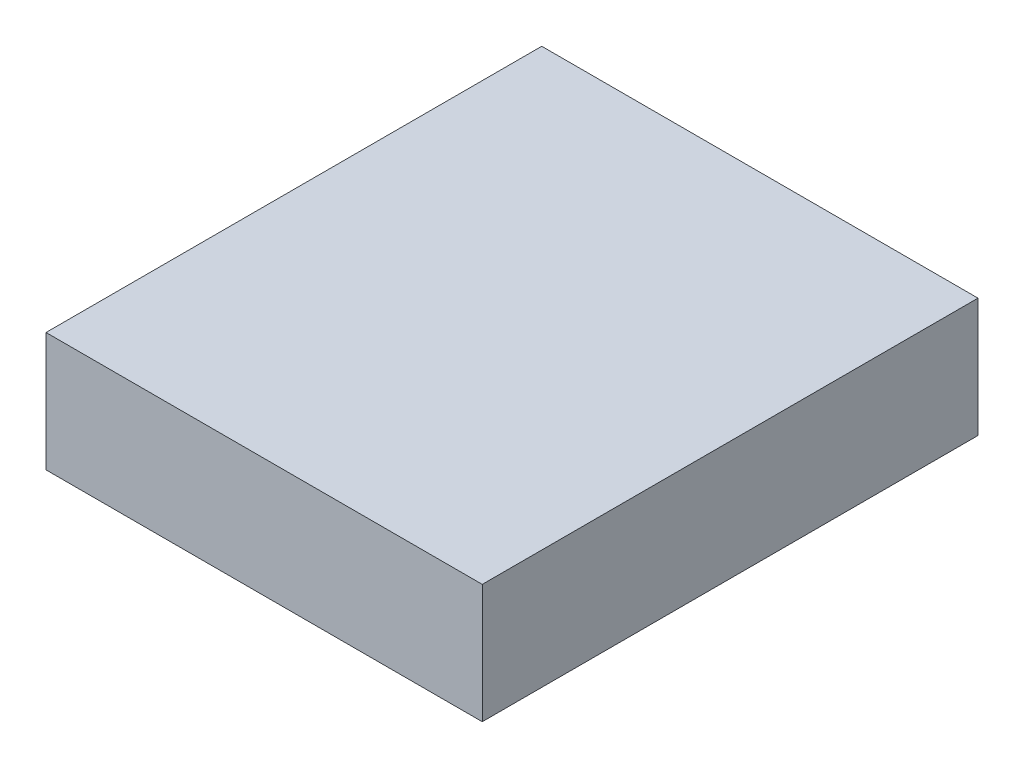
ISO-10303-21;
HEADER;
FILE_DESCRIPTION(('STEP AP214'),'2;1');
FILE_NAME('part.step','',(''),(''),'','','');
FILE_SCHEMA(('AUTOMOTIVE_DESIGN { 1 0 10303 214 1 1 1 1 }'));
ENDSEC;
DATA;
#1=APPLICATION_CONTEXT('core data for automotive mechanical design processes');
#2=APPLICATION_PROTOCOL_DEFINITION('international standard','automotive_design',2000,#1);
#3=PRODUCT_CONTEXT('',#1,'mechanical');
#4=PRODUCT('Part','Part','',(#3));
#5=PRODUCT_RELATED_PRODUCT_CATEGORY('part','',(#4));
#6=PRODUCT_DEFINITION_FORMATION('','',#4);
#7=PRODUCT_DEFINITION_CONTEXT('part definition',#1,'design');
#8=PRODUCT_DEFINITION('design','',#6,#7);
#9=PRODUCT_DEFINITION_SHAPE('','',#8);
#10=(LENGTH_UNIT() NAMED_UNIT(*) SI_UNIT(.MILLI.,.METRE.));
#11=(NAMED_UNIT(*) PLANE_ANGLE_UNIT() SI_UNIT($,.RADIAN.));
#12=(NAMED_UNIT(*) SI_UNIT($,.STERADIAN.) SOLID_ANGLE_UNIT());
#13=UNCERTAINTY_MEASURE_WITH_UNIT(LENGTH_MEASURE(1.E-05),#10,'distance_accuracy_value','');
#14=(GEOMETRIC_REPRESENTATION_CONTEXT(3) GLOBAL_UNCERTAINTY_ASSIGNED_CONTEXT((#13)) GLOBAL_UNIT_ASSIGNED_CONTEXT((#10,
#11,#12)) REPRESENTATION_CONTEXT('',''));
#15=CARTESIAN_POINT('',(0.,0.,0.));
#16=DIRECTION('',(0.,0.,1.));
#17=DIRECTION('',(1.,0.,0.));
#18=AXIS2_PLACEMENT_3D('',#15,#16,#17);
#19=CARTESIAN_POINT('',(0.7,6.6,-36.9));
#20=DIRECTION('',(0.,-1.,0.));
#21=DIRECTION('',(0.,0.,-1.));
#22=AXIS2_PLACEMENT_3D('',#19,#20,#21);
#23=PLANE('',#22);
#24=DIRECTION('',(-1.,0.,0.));
#25=VECTOR('',#24,1.);
#26=CARTESIAN_POINT('',(2.9,6.6,-41.9));
#27=LINE('',#26,#25);
#28=CARTESIAN_POINT('',(5.1,6.6,-41.9));
#29=VERTEX_POINT('',#28);
#30=CARTESIAN_POINT('',(0.7,6.6,-41.9));
#31=VERTEX_POINT('',#30);
#32=EDGE_CURVE('E54',#29,#31,#27,.T.);
#33=ORIENTED_EDGE('',*,*,#32,.F.);
#34=DIRECTION('',(0.,0.,-1.));
#35=VECTOR('',#34,1.);
#36=CARTESIAN_POINT('',(5.1,6.6,-39.4));
#37=LINE('',#36,#35);
#38=CARTESIAN_POINT('',(5.1,6.6,-36.9));
#39=VERTEX_POINT('',#38);
#40=EDGE_CURVE('E69',#39,#29,#37,.T.);
#41=ORIENTED_EDGE('',*,*,#40,.F.);
#42=DIRECTION('',(1.,0.,0.));
#43=VECTOR('',#42,1.);
#44=CARTESIAN_POINT('',(2.9,6.6,-36.9));
#45=LINE('',#44,#43);
#46=CARTESIAN_POINT('',(0.7,6.6,-36.9));
#47=VERTEX_POINT('',#46);
#48=EDGE_CURVE('E21',#47,#39,#45,.T.);
#49=ORIENTED_EDGE('',*,*,#48,.F.);
#50=DIRECTION('',(0.,0.,1.));
#51=VECTOR('',#50,1.);
#52=CARTESIAN_POINT('',(0.7,6.6,-39.4));
#53=LINE('',#52,#51);
#54=EDGE_CURVE('E59',#31,#47,#53,.T.);
#55=ORIENTED_EDGE('',*,*,#54,.F.);
#56=EDGE_LOOP('',(#33,#41,#49,#55));
#57=FACE_BOUND('',#56,.T.);
#58=ADVANCED_FACE('F17',(#57),#23,.T.);
#59=CARTESIAN_POINT('',(5.1,7.8,-36.9));
#60=DIRECTION('',(0.,0.,1.));
#61=DIRECTION('',(-1.,0.,0.));
#62=AXIS2_PLACEMENT_3D('',#59,#60,#61);
#63=PLANE('',#62);
#64=ORIENTED_EDGE('',*,*,#48,.T.);
#65=DIRECTION('',(0.,-1.,0.));
#66=VECTOR('',#65,1.);
#67=CARTESIAN_POINT('',(5.1,7.2,-36.9));
#68=LINE('',#67,#66);
#69=CARTESIAN_POINT('',(5.1,7.8,-36.9));
#70=VERTEX_POINT('',#69);
#71=EDGE_CURVE('E80',#70,#39,#68,.T.);
#72=ORIENTED_EDGE('',*,*,#71,.F.);
#73=DIRECTION('',(-1.,0.,0.));
#74=VECTOR('',#73,1.);
#75=CARTESIAN_POINT('',(2.9,7.8,-36.9));
#76=LINE('',#75,#74);
#77=CARTESIAN_POINT('',(0.7,7.8,-36.9));
#78=VERTEX_POINT('',#77);
#79=EDGE_CURVE('E75',#70,#78,#76,.T.);
#80=ORIENTED_EDGE('',*,*,#79,.T.);
#81=DIRECTION('',(0.,1.,0.));
#82=VECTOR('',#81,1.);
#83=CARTESIAN_POINT('',(0.7,7.2,-36.9));
#84=LINE('',#83,#82);
#85=EDGE_CURVE('E64',#47,#78,#84,.T.);
#86=ORIENTED_EDGE('',*,*,#85,.F.);
#87=EDGE_LOOP('',(#64,#72,#80,#86));
#88=FACE_BOUND('',#87,.T.);
#89=ADVANCED_FACE('F74',(#88),#63,.T.);
#90=CARTESIAN_POINT('',(0.7,7.8,-36.9));
#91=DIRECTION('',(-1.,0.,0.));
#92=DIRECTION('',(0.,0.,-1.));
#93=AXIS2_PLACEMENT_3D('',#90,#91,#92);
#94=PLANE('',#93);
#95=ORIENTED_EDGE('',*,*,#54,.T.);
#96=ORIENTED_EDGE('',*,*,#85,.T.);
#97=DIRECTION('',(0.,0.,-1.));
#98=VECTOR('',#97,1.);
#99=CARTESIAN_POINT('',(0.7,7.8,-39.4));
#100=LINE('',#99,#98);
#101=CARTESIAN_POINT('',(0.7,7.8,-41.9));
#102=VERTEX_POINT('',#101);
#103=EDGE_CURVE('E85',#78,#102,#100,.T.);
#104=ORIENTED_EDGE('',*,*,#103,.T.);
#105=DIRECTION('',(0.,1.,0.));
#106=VECTOR('',#105,1.);
#107=CARTESIAN_POINT('',(0.7,7.2,-41.9));
#108=LINE('',#107,#106);
#109=EDGE_CURVE('E66',#31,#102,#108,.T.);
#110=ORIENTED_EDGE('',*,*,#109,.F.);
#111=EDGE_LOOP('',(#95,#96,#104,#110));
#112=FACE_BOUND('',#111,.T.);
#113=ADVANCED_FACE('F61',(#112),#94,.T.);
#114=CARTESIAN_POINT('',(0.7,7.8,-41.9));
#115=DIRECTION('',(0.,0.,-1.));
#116=DIRECTION('',(1.,0.,0.));
#117=AXIS2_PLACEMENT_3D('',#114,#115,#116);
#118=PLANE('',#117);
#119=ORIENTED_EDGE('',*,*,#32,.T.);
#120=ORIENTED_EDGE('',*,*,#109,.T.);
#121=DIRECTION('',(1.,0.,0.));
#122=VECTOR('',#121,1.);
#123=CARTESIAN_POINT('',(2.9,7.8,-41.9));
#124=LINE('',#123,#122);
#125=CARTESIAN_POINT('',(5.1,7.8,-41.9));
#126=VERTEX_POINT('',#125);
#127=EDGE_CURVE('E27',#102,#126,#124,.T.);
#128=ORIENTED_EDGE('',*,*,#127,.T.);
#129=DIRECTION('',(0.,1.,0.));
#130=VECTOR('',#129,1.);
#131=CARTESIAN_POINT('',(5.1,7.2,-41.9));
#132=LINE('',#131,#130);
#133=EDGE_CURVE('E35',#29,#126,#132,.T.);
#134=ORIENTED_EDGE('',*,*,#133,.F.);
#135=EDGE_LOOP('',(#119,#120,#128,#134));
#136=FACE_BOUND('',#135,.T.);
#137=ADVANCED_FACE('F89',(#136),#118,.T.);
#138=CARTESIAN_POINT('',(5.1,7.8,-41.9));
#139=DIRECTION('',(1.,0.,0.));
#140=DIRECTION('',(0.,0.,1.));
#141=AXIS2_PLACEMENT_3D('',#138,#139,#140);
#142=PLANE('',#141);
#143=ORIENTED_EDGE('',*,*,#40,.T.);
#144=ORIENTED_EDGE('',*,*,#133,.T.);
#145=DIRECTION('',(0.,0.,1.));
#146=VECTOR('',#145,1.);
#147=CARTESIAN_POINT('',(5.1,7.8,-39.4));
#148=LINE('',#147,#146);
#149=EDGE_CURVE('E11',#126,#70,#148,.T.);
#150=ORIENTED_EDGE('',*,*,#149,.T.);
#151=ORIENTED_EDGE('',*,*,#71,.T.);
#152=EDGE_LOOP('',(#143,#144,#150,#151));
#153=FACE_BOUND('',#152,.T.);
#154=ADVANCED_FACE('F91',(#153),#142,.T.);
#155=CARTESIAN_POINT('',(0.7,7.8,-36.9));
#156=DIRECTION('',(0.,-1.,0.));
#157=DIRECTION('',(0.,0.,-1.));
#158=AXIS2_PLACEMENT_3D('',#155,#156,#157);
#159=PLANE('',#158);
#160=ORIENTED_EDGE('',*,*,#127,.F.);
#161=ORIENTED_EDGE('',*,*,#103,.F.);
#162=ORIENTED_EDGE('',*,*,#79,.F.);
#163=ORIENTED_EDGE('',*,*,#149,.F.);
#164=EDGE_LOOP('',(#160,#161,#162,#163));
#165=FACE_BOUND('',#164,.T.);
#166=ADVANCED_FACE('F19',(#165),#159,.F.);
#167=CLOSED_SHELL('',(#58,#89,#113,#137,#154,#166));
#168=MANIFOLD_SOLID_BREP('B1',#167);
#169=ADVANCED_BREP_SHAPE_REPRESENTATION('',(#18,#168),#14);
#170=SHAPE_DEFINITION_REPRESENTATION(#9,#169);
ENDSEC;
END-ISO-10303-21;
